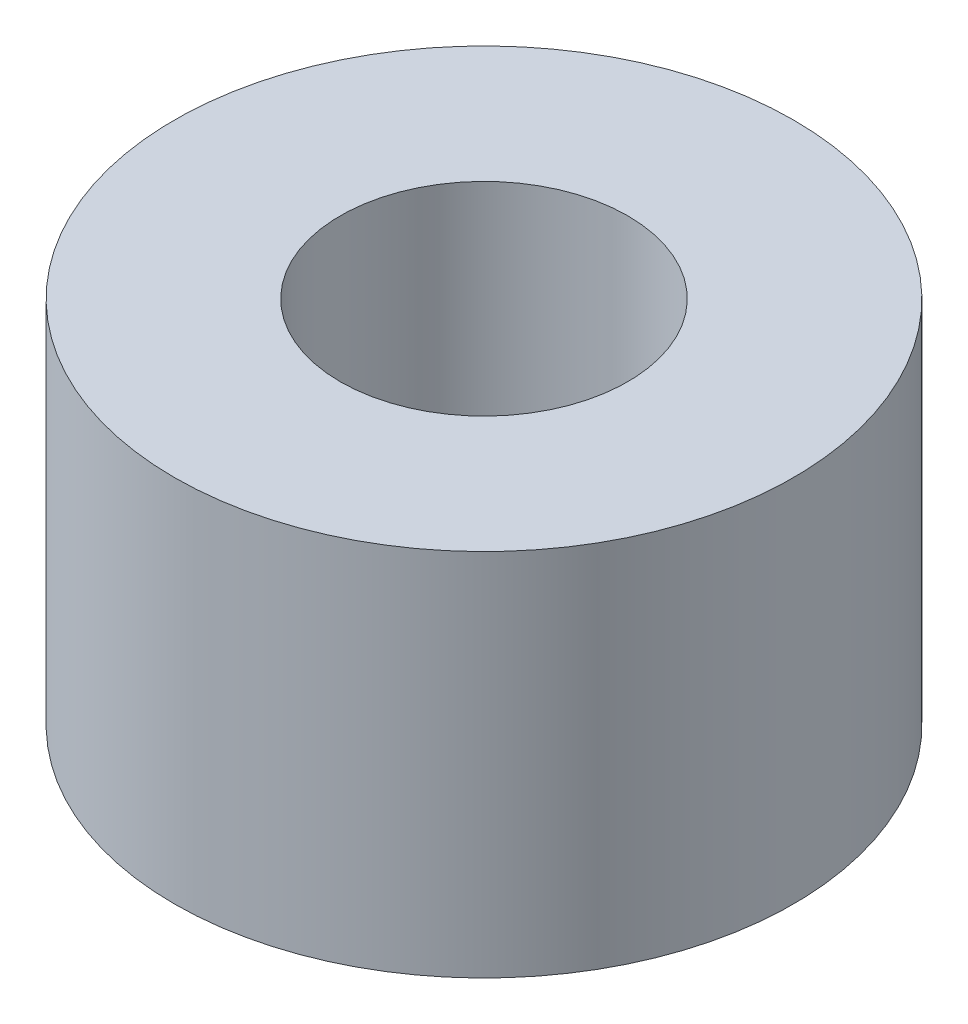
ISO-10303-21;
HEADER;
FILE_DESCRIPTION(('STEP AP214'),'2;1');
FILE_NAME('part.step','',(''),(''),'','','');
FILE_SCHEMA(('AUTOMOTIVE_DESIGN { 1 0 10303 214 1 1 1 1 }'));
ENDSEC;
DATA;
#1=APPLICATION_CONTEXT('core data for automotive mechanical design processes');
#2=APPLICATION_PROTOCOL_DEFINITION('international standard','automotive_design',2000,#1);
#3=PRODUCT_CONTEXT('',#1,'mechanical');
#4=PRODUCT('Part','Part','',(#3));
#5=PRODUCT_RELATED_PRODUCT_CATEGORY('part','',(#4));
#6=PRODUCT_DEFINITION_FORMATION('','',#4);
#7=PRODUCT_DEFINITION_CONTEXT('part definition',#1,'design');
#8=PRODUCT_DEFINITION('design','',#6,#7);
#9=PRODUCT_DEFINITION_SHAPE('','',#8);
#10=(LENGTH_UNIT() NAMED_UNIT(*) SI_UNIT(.MILLI.,.METRE.));
#11=(NAMED_UNIT(*) PLANE_ANGLE_UNIT() SI_UNIT($,.RADIAN.));
#12=(NAMED_UNIT(*) SI_UNIT($,.STERADIAN.) SOLID_ANGLE_UNIT());
#13=UNCERTAINTY_MEASURE_WITH_UNIT(LENGTH_MEASURE(1.E-05),#10,'distance_accuracy_value','');
#14=(GEOMETRIC_REPRESENTATION_CONTEXT(3) GLOBAL_UNCERTAINTY_ASSIGNED_CONTEXT((#13)) GLOBAL_UNIT_ASSIGNED_CONTEXT((#10,
#11,#12)) REPRESENTATION_CONTEXT('',''));
#15=CARTESIAN_POINT('',(0.,0.,0.));
#16=DIRECTION('',(0.,0.,1.));
#17=DIRECTION('',(1.,0.,0.));
#18=AXIS2_PLACEMENT_3D('',#15,#16,#17);
#19=CARTESIAN_POINT('',(0.,2.0875,0.));
#20=DIRECTION('',(0.,1.,0.));
#21=DIRECTION('',(0.,0.,1.));
#22=AXIS2_PLACEMENT_3D('',#19,#20,#21);
#23=PLANE('',#22);
#24=CARTESIAN_POINT('',(0.,2.0875,0.));
#25=DIRECTION('',(0.,1.,0.));
#26=DIRECTION('',(0.,0.,1.));
#27=AXIS2_PLACEMENT_3D('',#24,#25,#26);
#28=CIRCLE('',#27,3.5);
#29=CARTESIAN_POINT('',(0.,2.0875,3.5));
#30=VERTEX_POINT('',#29);
#31=EDGE_CURVE('E10',#30,#30,#28,.T.);
#32=ORIENTED_EDGE('',*,*,#31,.T.);
#33=EDGE_LOOP('',(#32));
#34=FACE_BOUND('',#33,.T.);
#35=CARTESIAN_POINT('',(0.,2.0875,0.));
#36=DIRECTION('',(0.,1.,0.));
#37=DIRECTION('',(0.,0.,1.));
#38=AXIS2_PLACEMENT_3D('',#35,#36,#37);
#39=CIRCLE('',#38,1.625);
#40=CARTESIAN_POINT('',(0.,2.0875,1.625));
#41=VERTEX_POINT('',#40);
#42=EDGE_CURVE('E43',#41,#41,#39,.T.);
#43=ORIENTED_EDGE('',*,*,#42,.F.);
#44=EDGE_LOOP('',(#43));
#45=FACE_BOUND('',#44,.T.);
#46=ADVANCED_FACE('F32',(#34,#45),#23,.T.);
#47=CARTESIAN_POINT('',(0.,-2.0875,0.));
#48=DIRECTION('',(0.,1.,0.));
#49=DIRECTION('',(0.,0.,1.));
#50=AXIS2_PLACEMENT_3D('',#47,#48,#49);
#51=PLANE('',#50);
#52=CARTESIAN_POINT('',(0.,-2.0875,0.));
#53=DIRECTION('',(0.,1.,0.));
#54=DIRECTION('',(0.,0.,1.));
#55=AXIS2_PLACEMENT_3D('',#52,#53,#54);
#56=CIRCLE('',#55,3.5);
#57=CARTESIAN_POINT('',(0.,-2.0875,3.5));
#58=VERTEX_POINT('',#57);
#59=EDGE_CURVE('E36',#58,#58,#56,.T.);
#60=ORIENTED_EDGE('',*,*,#59,.F.);
#61=EDGE_LOOP('',(#60));
#62=FACE_BOUND('',#61,.T.);
#63=CARTESIAN_POINT('',(0.,-2.0875,0.));
#64=DIRECTION('',(0.,1.,0.));
#65=DIRECTION('',(0.,0.,1.));
#66=AXIS2_PLACEMENT_3D('',#63,#64,#65);
#67=CIRCLE('',#66,1.625);
#68=CARTESIAN_POINT('',(0.,-2.0875,1.625));
#69=VERTEX_POINT('',#68);
#70=EDGE_CURVE('E45',#69,#69,#67,.T.);
#71=ORIENTED_EDGE('',*,*,#70,.T.);
#72=EDGE_LOOP('',(#71));
#73=FACE_BOUND('',#72,.T.);
#74=ADVANCED_FACE('F55',(#62,#73),#51,.F.);
#75=CARTESIAN_POINT('',(0.,2.0875,0.));
#76=DIRECTION('',(0.,-1.,0.));
#77=DIRECTION('',(0.,0.,-1.));
#78=AXIS2_PLACEMENT_3D('',#75,#76,#77);
#79=CYLINDRICAL_SURFACE('',#78,3.5);
#80=ORIENTED_EDGE('',*,*,#31,.F.);
#81=EDGE_LOOP('',(#80));
#82=FACE_BOUND('',#81,.T.);
#83=ORIENTED_EDGE('',*,*,#59,.T.);
#84=EDGE_LOOP('',(#83));
#85=FACE_BOUND('',#84,.T.);
#86=ADVANCED_FACE('F34',(#82,#85),#79,.T.);
#87=CARTESIAN_POINT('',(0.,2.0875,0.));
#88=DIRECTION('',(0.,-1.,0.));
#89=DIRECTION('',(0.,0.,-1.));
#90=AXIS2_PLACEMENT_3D('',#87,#88,#89);
#91=CYLINDRICAL_SURFACE('',#90,1.625);
#92=ORIENTED_EDGE('',*,*,#42,.T.);
#93=EDGE_LOOP('',(#92));
#94=FACE_BOUND('',#93,.T.);
#95=ORIENTED_EDGE('',*,*,#70,.F.);
#96=EDGE_LOOP('',(#95));
#97=FACE_BOUND('',#96,.T.);
#98=ADVANCED_FACE('F51',(#94,#97),#91,.F.);
#99=CLOSED_SHELL('',(#46,#74,#86,#98));
#100=MANIFOLD_SOLID_BREP('B2',#99);
#101=ADVANCED_BREP_SHAPE_REPRESENTATION('',(#18,#100),#14);
#102=SHAPE_DEFINITION_REPRESENTATION(#9,#101);
ENDSEC;
END-ISO-10303-21;
